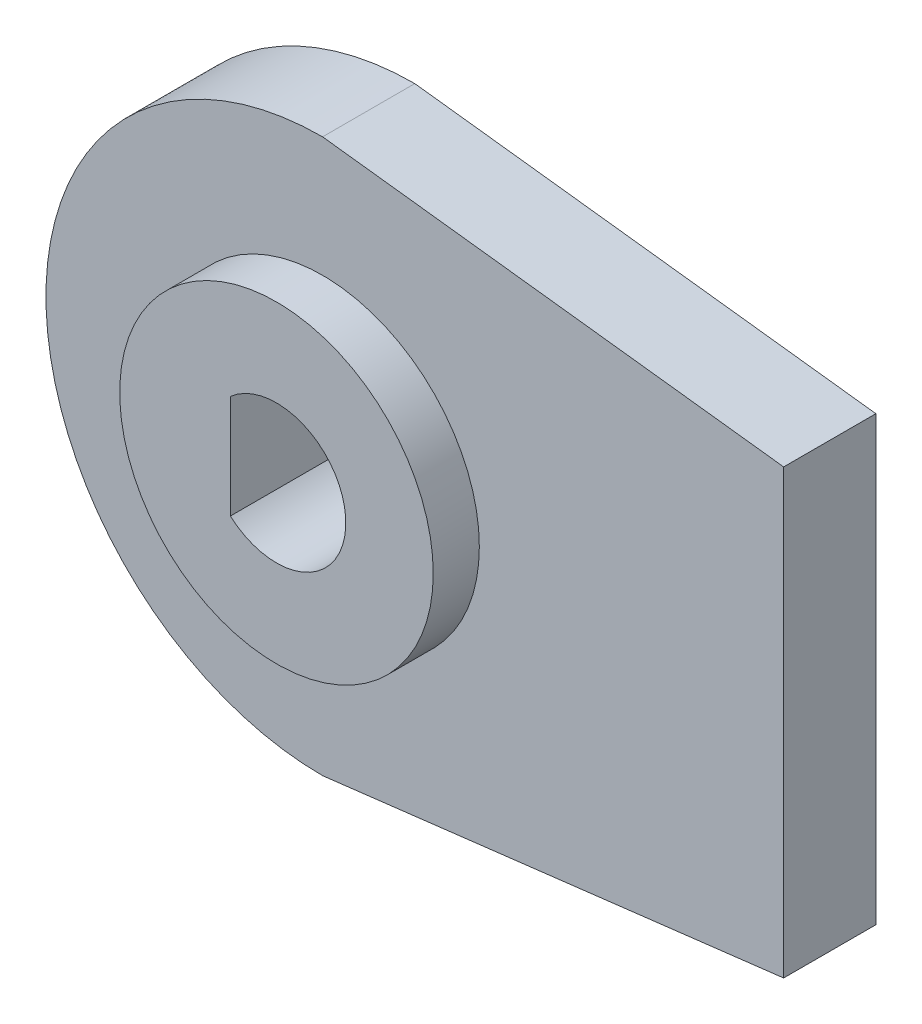
ISO-10303-21;
HEADER;
FILE_DESCRIPTION(('STEP AP214'),'2;1');
FILE_NAME('part.step','',(''),(''),'','','');
FILE_SCHEMA(('AUTOMOTIVE_DESIGN { 1 0 10303 214 1 1 1 1 }'));
ENDSEC;
DATA;
#1=APPLICATION_CONTEXT('core data for automotive mechanical design processes');
#2=APPLICATION_PROTOCOL_DEFINITION('international standard','automotive_design',2000,#1);
#3=PRODUCT_CONTEXT('',#1,'mechanical');
#4=PRODUCT('Part','Part','',(#3));
#5=PRODUCT_RELATED_PRODUCT_CATEGORY('part','',(#4));
#6=PRODUCT_DEFINITION_FORMATION('','',#4);
#7=PRODUCT_DEFINITION_CONTEXT('part definition',#1,'design');
#8=PRODUCT_DEFINITION('design','',#6,#7);
#9=PRODUCT_DEFINITION_SHAPE('','',#8);
#10=(LENGTH_UNIT() NAMED_UNIT(*) SI_UNIT(.MILLI.,.METRE.));
#11=(NAMED_UNIT(*) PLANE_ANGLE_UNIT() SI_UNIT($,.RADIAN.));
#12=(NAMED_UNIT(*) SI_UNIT($,.STERADIAN.) SOLID_ANGLE_UNIT());
#13=UNCERTAINTY_MEASURE_WITH_UNIT(LENGTH_MEASURE(1.E-05),#10,'distance_accuracy_value','');
#14=(GEOMETRIC_REPRESENTATION_CONTEXT(3) GLOBAL_UNCERTAINTY_ASSIGNED_CONTEXT((#13)) GLOBAL_UNIT_ASSIGNED_CONTEXT((#10,
#11,#12)) REPRESENTATION_CONTEXT('',''));
#15=CARTESIAN_POINT('',(0.,0.,0.));
#16=DIRECTION('',(0.,0.,1.));
#17=DIRECTION('',(1.,0.,0.));
#18=AXIS2_PLACEMENT_3D('',#15,#16,#17);
#19=CARTESIAN_POINT('',(0.,0.,2.));
#20=DIRECTION('',(0.,0.,-1.));
#21=DIRECTION('',(-1.,0.,0.));
#22=AXIS2_PLACEMENT_3D('',#19,#20,#21);
#23=CYLINDRICAL_SURFACE('',#22,6.);
#24=CARTESIAN_POINT('',(0.,0.,0.));
#25=DIRECTION('',(0.,0.,1.));
#26=DIRECTION('',(1.,0.,0.));
#27=AXIS2_PLACEMENT_3D('',#24,#25,#26);
#28=CIRCLE('',#27,6.);
#29=CARTESIAN_POINT('',(0.,6.,0.));
#30=VERTEX_POINT('',#29);
#31=CARTESIAN_POINT('',(0.,-6.,0.));
#32=VERTEX_POINT('',#31);
#33=EDGE_CURVE('E119',#30,#32,#28,.T.);
#34=ORIENTED_EDGE('',*,*,#33,.T.);
#35=DIRECTION('',(0.,0.,-1.));
#36=VECTOR('',#35,1.);
#37=CARTESIAN_POINT('',(0.,-6.,2.));
#38=LINE('',#37,#36);
#39=CARTESIAN_POINT('',(0.,-6.,2.));
#40=VERTEX_POINT('',#39);
#41=EDGE_CURVE('E42',#40,#32,#38,.T.);
#42=ORIENTED_EDGE('',*,*,#41,.F.);
#43=CARTESIAN_POINT('',(0.,0.,2.));
#44=DIRECTION('',(0.,0.,1.));
#45=DIRECTION('',(1.,0.,0.));
#46=AXIS2_PLACEMENT_3D('',#43,#44,#45);
#47=CIRCLE('',#46,6.);
#48=CARTESIAN_POINT('',(0.,6.,2.));
#49=VERTEX_POINT('',#48);
#50=EDGE_CURVE('E121',#49,#40,#47,.T.);
#51=ORIENTED_EDGE('',*,*,#50,.F.);
#52=DIRECTION('',(0.,0.,-1.));
#53=VECTOR('',#52,1.);
#54=CARTESIAN_POINT('',(0.,6.,2.));
#55=LINE('',#54,#53);
#56=EDGE_CURVE('E135',#49,#30,#55,.T.);
#57=ORIENTED_EDGE('',*,*,#56,.T.);
#58=EDGE_LOOP('',(#34,#42,#51,#57));
#59=FACE_BOUND('',#58,.T.);
#60=ADVANCED_FACE('F39',(#59),#23,.T.);
#61=CARTESIAN_POINT('',(0.,-6.,2.));
#62=DIRECTION('',(-0.119145220618431,0.992876838486922,0.));
#63=DIRECTION('',(-0.992876838486922,-0.119145220618431,0.));
#64=AXIS2_PLACEMENT_3D('',#61,#62,#63);
#65=PLANE('',#64);
#66=DIRECTION('',(0.992876838486922,0.119145220618431,0.));
#67=VECTOR('',#66,1.);
#68=CARTESIAN_POINT('',(0.,-6.,0.));
#69=LINE('',#68,#67);
#70=CARTESIAN_POINT('',(10.,-4.8,0.));
#71=VERTEX_POINT('',#70);
#72=EDGE_CURVE('E139',#32,#71,#69,.T.);
#73=ORIENTED_EDGE('',*,*,#72,.T.);
#74=DIRECTION('',(0.,0.,-1.));
#75=VECTOR('',#74,1.);
#76=CARTESIAN_POINT('',(10.,-4.8,2.));
#77=LINE('',#76,#75);
#78=CARTESIAN_POINT('',(10.,-4.8,2.));
#79=VERTEX_POINT('',#78);
#80=EDGE_CURVE('E153',#79,#71,#77,.T.);
#81=ORIENTED_EDGE('',*,*,#80,.F.);
#82=DIRECTION('',(0.992876838486922,0.119145220618431,0.));
#83=VECTOR('',#82,1.);
#84=CARTESIAN_POINT('',(0.,-6.,2.));
#85=LINE('',#84,#83);
#86=EDGE_CURVE('E125',#40,#79,#85,.T.);
#87=ORIENTED_EDGE('',*,*,#86,.F.);
#88=ORIENTED_EDGE('',*,*,#41,.T.);
#89=EDGE_LOOP('',(#73,#81,#87,#88));
#90=FACE_BOUND('',#89,.T.);
#91=ADVANCED_FACE('F164',(#90),#65,.F.);
#92=CARTESIAN_POINT('',(10.,-4.8,2.));
#93=DIRECTION('',(-1.,0.,0.));
#94=DIRECTION('',(0.,0.,1.));
#95=AXIS2_PLACEMENT_3D('',#92,#93,#94);
#96=PLANE('',#95);
#97=DIRECTION('',(0.,1.,0.));
#98=VECTOR('',#97,1.);
#99=CARTESIAN_POINT('',(10.,-4.8,0.));
#100=LINE('',#99,#98);
#101=CARTESIAN_POINT('',(10.,4.8,0.));
#102=VERTEX_POINT('',#101);
#103=EDGE_CURVE('E142',#71,#102,#100,.T.);
#104=ORIENTED_EDGE('',*,*,#103,.T.);
#105=DIRECTION('',(0.,0.,-1.));
#106=VECTOR('',#105,1.);
#107=CARTESIAN_POINT('',(10.,4.8,2.));
#108=LINE('',#107,#106);
#109=CARTESIAN_POINT('',(10.,4.8,2.));
#110=VERTEX_POINT('',#109);
#111=EDGE_CURVE('E150',#110,#102,#108,.T.);
#112=ORIENTED_EDGE('',*,*,#111,.F.);
#113=DIRECTION('',(0.,1.,0.));
#114=VECTOR('',#113,1.);
#115=CARTESIAN_POINT('',(10.,-4.8,2.));
#116=LINE('',#115,#114);
#117=EDGE_CURVE('E129',#79,#110,#116,.T.);
#118=ORIENTED_EDGE('',*,*,#117,.F.);
#119=ORIENTED_EDGE('',*,*,#80,.T.);
#120=EDGE_LOOP('',(#104,#112,#118,#119));
#121=FACE_BOUND('',#120,.T.);
#122=ADVANCED_FACE('F171',(#121),#96,.F.);
#123=CARTESIAN_POINT('',(0.,6.,2.));
#124=DIRECTION('',(-0.119145220618431,-0.992876838486922,0.));
#125=DIRECTION('',(0.992876838486922,-0.119145220618431,0.));
#126=AXIS2_PLACEMENT_3D('',#123,#124,#125);
#127=PLANE('',#126);
#128=DIRECTION('',(-0.992876838486922,0.119145220618431,0.));
#129=VECTOR('',#128,1.);
#130=CARTESIAN_POINT('',(0.,6.,0.));
#131=LINE('',#130,#129);
#132=EDGE_CURVE('E126',#102,#30,#131,.T.);
#133=ORIENTED_EDGE('',*,*,#132,.T.);
#134=ORIENTED_EDGE('',*,*,#56,.F.);
#135=DIRECTION('',(-0.992876838486922,0.119145220618431,0.));
#136=VECTOR('',#135,1.);
#137=CARTESIAN_POINT('',(0.,6.,2.));
#138=LINE('',#137,#136);
#139=EDGE_CURVE('E132',#110,#49,#138,.T.);
#140=ORIENTED_EDGE('',*,*,#139,.F.);
#141=ORIENTED_EDGE('',*,*,#111,.T.);
#142=EDGE_LOOP('',(#133,#134,#140,#141));
#143=FACE_BOUND('',#142,.T.);
#144=ADVANCED_FACE('F174',(#143),#127,.F.);
#145=CARTESIAN_POINT('',(0.,0.,2.));
#146=DIRECTION('',(0.,0.,1.));
#147=DIRECTION('',(1.,0.,0.));
#148=AXIS2_PLACEMENT_3D('',#145,#146,#147);
#149=PLANE('',#148);
#150=CARTESIAN_POINT('',(0.,0.,2.));
#151=DIRECTION('',(0.,0.,1.));
#152=DIRECTION('',(1.,0.,0.));
#153=AXIS2_PLACEMENT_3D('',#150,#151,#152);
#154=CIRCLE('',#153,3.4);
#155=CARTESIAN_POINT('',(3.4,0.,2.));
#156=VERTEX_POINT('',#155);
#157=EDGE_CURVE('E11',#156,#156,#154,.T.);
#158=ORIENTED_EDGE('',*,*,#157,.F.);
#159=EDGE_LOOP('',(#158));
#160=FACE_BOUND('',#159,.T.);
#161=ORIENTED_EDGE('',*,*,#50,.T.);
#162=ORIENTED_EDGE('',*,*,#86,.T.);
#163=ORIENTED_EDGE('',*,*,#117,.T.);
#164=ORIENTED_EDGE('',*,*,#139,.T.);
#165=EDGE_LOOP('',(#161,#162,#163,#164));
#166=FACE_BOUND('',#165,.T.);
#167=ADVANCED_FACE('F176',(#160,#166),#149,.T.);
#168=CARTESIAN_POINT('',(0.,0.,0.));
#169=DIRECTION('',(0.,0.,1.));
#170=DIRECTION('',(1.,0.,0.));
#171=AXIS2_PLACEMENT_3D('',#168,#169,#170);
#172=PLANE('',#171);
#173=DIRECTION('',(0.,-1.,0.));
#174=VECTOR('',#173,1.);
#175=CARTESIAN_POINT('',(-1.,1.12293017841883,0.));
#176=LINE('',#175,#174);
#177=CARTESIAN_POINT('',(-1.,1.12293017841883,0.));
#178=VERTEX_POINT('',#177);
#179=CARTESIAN_POINT('',(-1.,-1.12293017841883,0.));
#180=VERTEX_POINT('',#179);
#181=EDGE_CURVE('E97',#178,#180,#176,.T.);
#182=ORIENTED_EDGE('',*,*,#181,.T.);
#183=CARTESIAN_POINT('',(0.,0.,0.));
#184=DIRECTION('',(0.,0.,1.));
#185=DIRECTION('',(1.,0.,0.));
#186=AXIS2_PLACEMENT_3D('',#183,#184,#185);
#187=CIRCLE('',#186,1.50365294719351);
#188=EDGE_CURVE('E55',#180,#178,#187,.T.);
#189=ORIENTED_EDGE('',*,*,#188,.T.);
#190=EDGE_LOOP('',(#182,#189));
#191=FACE_BOUND('',#190,.T.);
#192=ORIENTED_EDGE('',*,*,#33,.F.);
#193=ORIENTED_EDGE('',*,*,#132,.F.);
#194=ORIENTED_EDGE('',*,*,#103,.F.);
#195=ORIENTED_EDGE('',*,*,#72,.F.);
#196=EDGE_LOOP('',(#192,#193,#194,#195));
#197=FACE_BOUND('',#196,.T.);
#198=ADVANCED_FACE('F104',(#191,#197),#172,.F.);
#199=CARTESIAN_POINT('',(0.,0.,3.));
#200=DIRECTION('',(0.,0.,-1.));
#201=DIRECTION('',(-1.,0.,0.));
#202=AXIS2_PLACEMENT_3D('',#199,#200,#201);
#203=CYLINDRICAL_SURFACE('',#202,3.4);
#204=CARTESIAN_POINT('',(0.,0.,3.));
#205=DIRECTION('',(0.,0.,1.));
#206=DIRECTION('',(1.,0.,0.));
#207=AXIS2_PLACEMENT_3D('',#204,#205,#206);
#208=CIRCLE('',#207,3.4);
#209=CARTESIAN_POINT('',(3.4,0.,3.));
#210=VERTEX_POINT('',#209);
#211=EDGE_CURVE('E115',#210,#210,#208,.T.);
#212=ORIENTED_EDGE('',*,*,#211,.F.);
#213=EDGE_LOOP('',(#212));
#214=FACE_BOUND('',#213,.T.);
#215=ORIENTED_EDGE('',*,*,#157,.T.);
#216=EDGE_LOOP('',(#215));
#217=FACE_BOUND('',#216,.T.);
#218=ADVANCED_FACE('F184',(#214,#217),#203,.T.);
#219=CARTESIAN_POINT('',(0.,0.,3.));
#220=DIRECTION('',(0.,0.,1.));
#221=DIRECTION('',(1.,0.,0.));
#222=AXIS2_PLACEMENT_3D('',#219,#220,#221);
#223=PLANE('',#222);
#224=CARTESIAN_POINT('',(0.,0.,3.));
#225=DIRECTION('',(0.,0.,1.));
#226=DIRECTION('',(1.,0.,0.));
#227=AXIS2_PLACEMENT_3D('',#224,#225,#226);
#228=CIRCLE('',#227,1.50365294719351);
#229=CARTESIAN_POINT('',(-1.,-1.12293017841883,3.));
#230=VERTEX_POINT('',#229);
#231=CARTESIAN_POINT('',(-1.,1.12293017841883,3.));
#232=VERTEX_POINT('',#231);
#233=EDGE_CURVE('E60',#230,#232,#228,.T.);
#234=ORIENTED_EDGE('',*,*,#233,.F.);
#235=DIRECTION('',(0.,-1.,0.));
#236=VECTOR('',#235,1.);
#237=CARTESIAN_POINT('',(-1.,1.12293017841883,3.));
#238=LINE('',#237,#236);
#239=EDGE_CURVE('E107',#232,#230,#238,.T.);
#240=ORIENTED_EDGE('',*,*,#239,.F.);
#241=EDGE_LOOP('',(#234,#240));
#242=FACE_BOUND('',#241,.T.);
#243=ORIENTED_EDGE('',*,*,#211,.T.);
#244=EDGE_LOOP('',(#243));
#245=FACE_BOUND('',#244,.T.);
#246=ADVANCED_FACE('F218',(#242,#245),#223,.T.);
#247=CARTESIAN_POINT('',(0.,0.,0.));
#248=DIRECTION('',(0.,0.,1.));
#249=DIRECTION('',(1.,0.,0.));
#250=AXIS2_PLACEMENT_3D('',#247,#248,#249);
#251=CYLINDRICAL_SURFACE('',#250,1.50365294719351);
#252=ORIENTED_EDGE('',*,*,#233,.T.);
#253=DIRECTION('',(0.,0.,1.));
#254=VECTOR('',#253,1.);
#255=CARTESIAN_POINT('',(-1.,1.12293017841883,0.));
#256=LINE('',#255,#254);
#257=EDGE_CURVE('E89',#178,#232,#256,.T.);
#258=ORIENTED_EDGE('',*,*,#257,.F.);
#259=ORIENTED_EDGE('',*,*,#188,.F.);
#260=DIRECTION('',(0.,0.,1.));
#261=VECTOR('',#260,1.);
#262=CARTESIAN_POINT('',(-1.,-1.12293017841883,0.));
#263=LINE('',#262,#261);
#264=EDGE_CURVE('E96',#180,#230,#263,.T.);
#265=ORIENTED_EDGE('',*,*,#264,.T.);
#266=EDGE_LOOP('',(#252,#258,#259,#265));
#267=FACE_BOUND('',#266,.T.);
#268=ADVANCED_FACE('F91',(#267),#251,.F.);
#269=CARTESIAN_POINT('',(-1.,1.12293017841883,0.));
#270=DIRECTION('',(-1.,0.,0.));
#271=DIRECTION('',(0.,0.,1.));
#272=AXIS2_PLACEMENT_3D('',#269,#270,#271);
#273=PLANE('',#272);
#274=ORIENTED_EDGE('',*,*,#239,.T.);
#275=ORIENTED_EDGE('',*,*,#264,.F.);
#276=ORIENTED_EDGE('',*,*,#181,.F.);
#277=ORIENTED_EDGE('',*,*,#257,.T.);
#278=EDGE_LOOP('',(#274,#275,#276,#277));
#279=FACE_BOUND('',#278,.T.);
#280=ADVANCED_FACE('F100',(#279),#273,.F.);
#281=CLOSED_SHELL('',(#60,#91,#122,#144,#167,#198,#218,#246,#268,#280));
#282=MANIFOLD_SOLID_BREP('B2',#281);
#283=ADVANCED_BREP_SHAPE_REPRESENTATION('',(#18,#282),#14);
#284=SHAPE_DEFINITION_REPRESENTATION(#9,#283);
ENDSEC;
END-ISO-10303-21;
